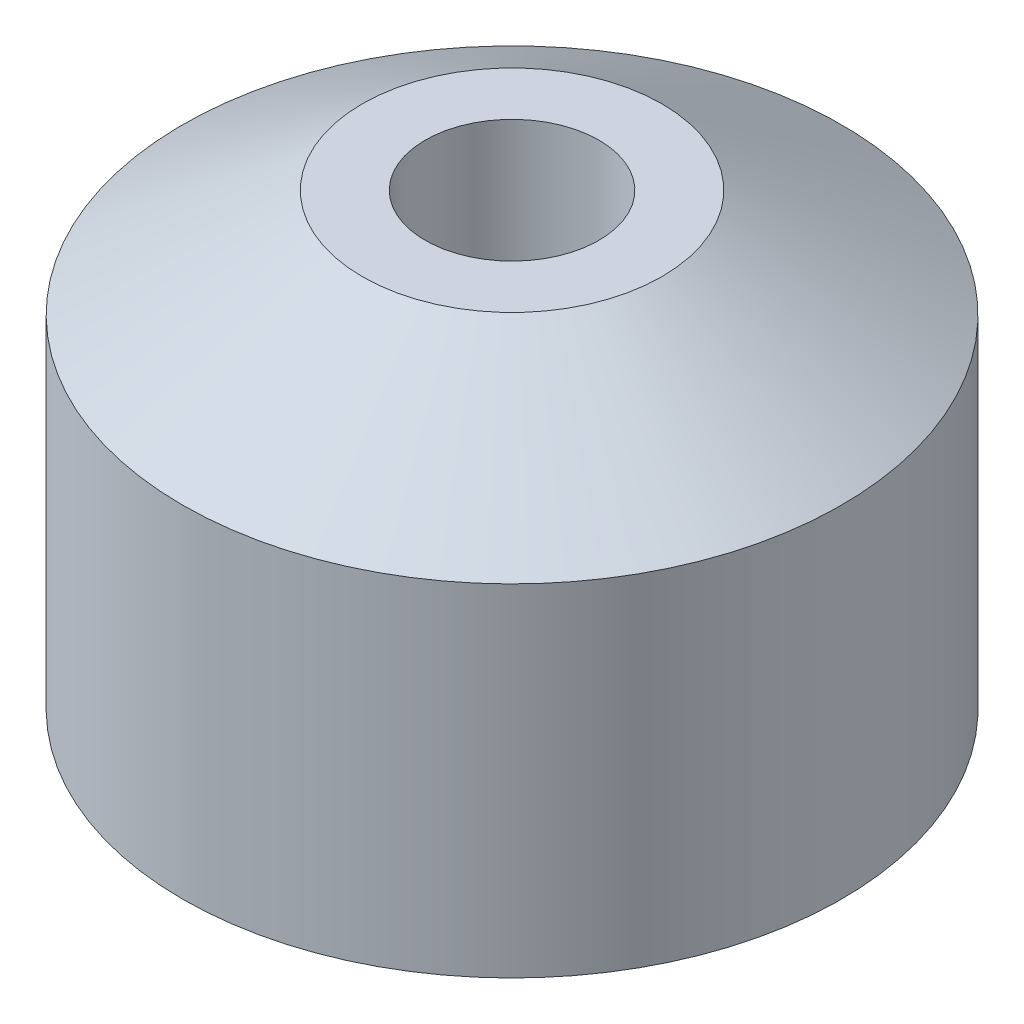
ISO-10303-21;
HEADER;
FILE_DESCRIPTION(('STEP AP214'),'2;1');
FILE_NAME('part.step','',(''),(''),'','','');
FILE_SCHEMA(('AUTOMOTIVE_DESIGN { 1 0 10303 214 1 1 1 1 }'));
ENDSEC;
DATA;
#1=APPLICATION_CONTEXT('core data for automotive mechanical design processes');
#2=APPLICATION_PROTOCOL_DEFINITION('international standard','automotive_design',2000,#1);
#3=PRODUCT_CONTEXT('',#1,'mechanical');
#4=PRODUCT('Part','Part','',(#3));
#5=PRODUCT_RELATED_PRODUCT_CATEGORY('part','',(#4));
#6=PRODUCT_DEFINITION_FORMATION('','',#4);
#7=PRODUCT_DEFINITION_CONTEXT('part definition',#1,'design');
#8=PRODUCT_DEFINITION('design','',#6,#7);
#9=PRODUCT_DEFINITION_SHAPE('','',#8);
#10=(LENGTH_UNIT() NAMED_UNIT(*) SI_UNIT(.MILLI.,.METRE.));
#11=(NAMED_UNIT(*) PLANE_ANGLE_UNIT() SI_UNIT($,.RADIAN.));
#12=(NAMED_UNIT(*) SI_UNIT($,.STERADIAN.) SOLID_ANGLE_UNIT());
#13=UNCERTAINTY_MEASURE_WITH_UNIT(LENGTH_MEASURE(1.E-05),#10,'distance_accuracy_value','');
#14=(GEOMETRIC_REPRESENTATION_CONTEXT(3) GLOBAL_UNCERTAINTY_ASSIGNED_CONTEXT((#13)) GLOBAL_UNIT_ASSIGNED_CONTEXT((#10,
#11,#12)) REPRESENTATION_CONTEXT('',''));
#15=CARTESIAN_POINT('',(0.,0.,0.));
#16=DIRECTION('',(0.,0.,1.));
#17=DIRECTION('',(1.,0.,0.));
#18=AXIS2_PLACEMENT_3D('',#15,#16,#17);
#19=CARTESIAN_POINT('',(0.,7.5,0.));
#20=DIRECTION('',(0.,-1.,0.));
#21=DIRECTION('',(0.,0.,-1.));
#22=AXIS2_PLACEMENT_3D('',#19,#20,#21);
#23=CONICAL_SURFACE('',#22,2.5,1.02974425867666);
#24=CARTESIAN_POINT('',(0.,5.69741814291733,0.));
#25=DIRECTION('',(0.,1.,0.));
#26=DIRECTION('',(0.,0.,1.));
#27=AXIS2_PLACEMENT_3D('',#24,#25,#26);
#28=CIRCLE('',#27,5.5);
#29=CARTESIAN_POINT('',(0.,5.69741814291733,5.5));
#30=VERTEX_POINT('',#29);
#31=EDGE_CURVE('E10',#30,#30,#28,.T.);
#32=ORIENTED_EDGE('',*,*,#31,.T.);
#33=EDGE_LOOP('',(#32));
#34=FACE_BOUND('',#33,.T.);
#35=CARTESIAN_POINT('',(0.,7.5,0.));
#36=DIRECTION('',(0.,1.,0.));
#37=DIRECTION('',(0.,0.,1.));
#38=AXIS2_PLACEMENT_3D('',#35,#36,#37);
#39=CIRCLE('',#38,2.5);
#40=CARTESIAN_POINT('',(0.,7.5,2.5));
#41=VERTEX_POINT('',#40);
#42=EDGE_CURVE('E49',#41,#41,#39,.T.);
#43=ORIENTED_EDGE('',*,*,#42,.F.);
#44=EDGE_LOOP('',(#43));
#45=FACE_BOUND('',#44,.T.);
#46=ADVANCED_FACE('F37',(#34,#45),#23,.T.);
#47=CARTESIAN_POINT('',(0.,7.5,0.));
#48=DIRECTION('',(0.,1.,0.));
#49=DIRECTION('',(0.,0.,1.));
#50=AXIS2_PLACEMENT_3D('',#47,#48,#49);
#51=CYLINDRICAL_SURFACE('',#50,5.5);
#52=CARTESIAN_POINT('',(0.,0.,0.));
#53=DIRECTION('',(0.,1.,0.));
#54=DIRECTION('',(0.,0.,1.));
#55=AXIS2_PLACEMENT_3D('',#52,#53,#54);
#56=CIRCLE('',#55,5.5);
#57=CARTESIAN_POINT('',(0.,0.,5.5));
#58=VERTEX_POINT('',#57);
#59=EDGE_CURVE('E44',#58,#58,#56,.T.);
#60=ORIENTED_EDGE('',*,*,#59,.T.);
#61=EDGE_LOOP('',(#60));
#62=FACE_BOUND('',#61,.T.);
#63=ORIENTED_EDGE('',*,*,#31,.F.);
#64=EDGE_LOOP('',(#63));
#65=FACE_BOUND('',#64,.T.);
#66=ADVANCED_FACE('F79',(#62,#65),#51,.T.);
#67=CARTESIAN_POINT('',(0.,0.,5.5));
#68=DIRECTION('',(0.,-1.,0.));
#69=DIRECTION('',(0.,0.,-1.));
#70=AXIS2_PLACEMENT_3D('',#67,#68,#69);
#71=PLANE('',#70);
#72=CARTESIAN_POINT('',(0.,0.,0.));
#73=DIRECTION('',(0.,-1.,0.));
#74=DIRECTION('',(0.,0.,-1.));
#75=AXIS2_PLACEMENT_3D('',#72,#73,#74);
#76=CIRCLE('',#75,2.75);
#77=CARTESIAN_POINT('',(0.,0.,-2.75));
#78=VERTEX_POINT('',#77);
#79=EDGE_CURVE('E68',#78,#78,#76,.T.);
#80=ORIENTED_EDGE('',*,*,#79,.F.);
#81=EDGE_LOOP('',(#80));
#82=FACE_BOUND('',#81,.T.);
#83=ORIENTED_EDGE('',*,*,#59,.F.);
#84=EDGE_LOOP('',(#83));
#85=FACE_BOUND('',#84,.T.);
#86=ADVANCED_FACE('F75',(#82,#85),#71,.T.);
#87=CARTESIAN_POINT('',(0.,7.5,0.));
#88=DIRECTION('',(0.,1.,0.));
#89=DIRECTION('',(0.,0.,1.));
#90=AXIS2_PLACEMENT_3D('',#87,#88,#89);
#91=PLANE('',#90);
#92=CARTESIAN_POINT('',(0.,7.5,0.));
#93=DIRECTION('',(0.,-1.,0.));
#94=DIRECTION('',(0.,0.,-1.));
#95=AXIS2_PLACEMENT_3D('',#92,#93,#94);
#96=CIRCLE('',#95,1.45);
#97=CARTESIAN_POINT('',(0.,7.5,-1.45));
#98=VERTEX_POINT('',#97);
#99=EDGE_CURVE('E54',#98,#98,#96,.T.);
#100=ORIENTED_EDGE('',*,*,#99,.T.);
#101=EDGE_LOOP('',(#100));
#102=FACE_BOUND('',#101,.T.);
#103=ORIENTED_EDGE('',*,*,#42,.T.);
#104=EDGE_LOOP('',(#103));
#105=FACE_BOUND('',#104,.T.);
#106=ADVANCED_FACE('F78',(#102,#105),#91,.T.);
#107=CARTESIAN_POINT('',(0.,0.,0.));
#108=DIRECTION('',(0.,-1.,0.));
#109=DIRECTION('',(0.,0.,-1.));
#110=AXIS2_PLACEMENT_3D('',#107,#108,#109);
#111=CYLINDRICAL_SURFACE('',#110,1.45);
#112=ORIENTED_EDGE('',*,*,#99,.F.);
#113=EDGE_LOOP('',(#112));
#114=FACE_BOUND('',#113,.T.);
#115=CARTESIAN_POINT('',(0.,2.6,0.));
#116=DIRECTION('',(0.,-1.,0.));
#117=DIRECTION('',(0.,0.,-1.));
#118=AXIS2_PLACEMENT_3D('',#115,#116,#117);
#119=CIRCLE('',#118,1.45);
#120=CARTESIAN_POINT('',(0.,2.6,-1.45));
#121=VERTEX_POINT('',#120);
#122=EDGE_CURVE('E60',#121,#121,#119,.T.);
#123=ORIENTED_EDGE('',*,*,#122,.T.);
#124=EDGE_LOOP('',(#123));
#125=FACE_BOUND('',#124,.T.);
#126=ADVANCED_FACE('F85',(#114,#125),#111,.F.);
#127=CARTESIAN_POINT('',(1.45,2.6,0.));
#128=DIRECTION('',(0.,1.,0.));
#129=DIRECTION('',(0.,0.,1.));
#130=AXIS2_PLACEMENT_3D('',#127,#128,#129);
#131=PLANE('',#130);
#132=ORIENTED_EDGE('',*,*,#122,.F.);
#133=EDGE_LOOP('',(#132));
#134=FACE_BOUND('',#133,.T.);
#135=CARTESIAN_POINT('',(0.,2.6,0.));
#136=DIRECTION('',(0.,-1.,0.));
#137=DIRECTION('',(0.,0.,-1.));
#138=AXIS2_PLACEMENT_3D('',#135,#136,#137);
#139=CIRCLE('',#138,2.75);
#140=CARTESIAN_POINT('',(0.,2.6,-2.75));
#141=VERTEX_POINT('',#140);
#142=EDGE_CURVE('E64',#141,#141,#139,.T.);
#143=ORIENTED_EDGE('',*,*,#142,.T.);
#144=EDGE_LOOP('',(#143));
#145=FACE_BOUND('',#144,.T.);
#146=ADVANCED_FACE('F117',(#134,#145),#131,.F.);
#147=CARTESIAN_POINT('',(0.,0.,0.));
#148=DIRECTION('',(0.,-1.,0.));
#149=DIRECTION('',(0.,0.,-1.));
#150=AXIS2_PLACEMENT_3D('',#147,#148,#149);
#151=CYLINDRICAL_SURFACE('',#150,2.75);
#152=ORIENTED_EDGE('',*,*,#142,.F.);
#153=EDGE_LOOP('',(#152));
#154=FACE_BOUND('',#153,.T.);
#155=ORIENTED_EDGE('',*,*,#79,.T.);
#156=EDGE_LOOP('',(#155));
#157=FACE_BOUND('',#156,.T.);
#158=ADVANCED_FACE('F73',(#154,#157),#151,.F.);
#159=CLOSED_SHELL('',(#46,#66,#86,#106,#126,#146,#158));
#160=MANIFOLD_SOLID_BREP('B2',#159);
#161=ADVANCED_BREP_SHAPE_REPRESENTATION('',(#18,#160),#14);
#162=SHAPE_DEFINITION_REPRESENTATION(#9,#161);
ENDSEC;
END-ISO-10303-21;
